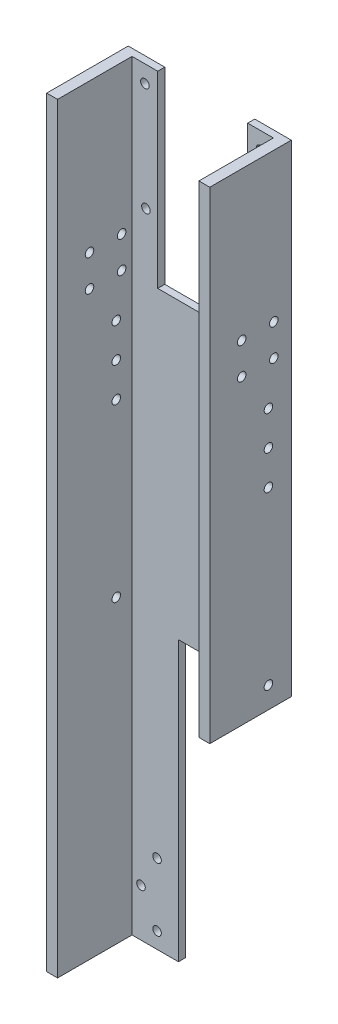
ISO-10303-21;
HEADER;
FILE_DESCRIPTION(('STEP AP214'),'2;1');
FILE_NAME('part.step','',(''),(''),'','','');
FILE_SCHEMA(('AUTOMOTIVE_DESIGN { 1 0 10303 214 1 1 1 1 }'));
ENDSEC;
DATA;
#1=APPLICATION_CONTEXT('core data for automotive mechanical design processes');
#2=APPLICATION_PROTOCOL_DEFINITION('international standard','automotive_design',2000,#1);
#3=PRODUCT_CONTEXT('',#1,'mechanical');
#4=PRODUCT('Part','Part','',(#3));
#5=PRODUCT_RELATED_PRODUCT_CATEGORY('part','',(#4));
#6=PRODUCT_DEFINITION_FORMATION('','',#4);
#7=PRODUCT_DEFINITION_CONTEXT('part definition',#1,'design');
#8=PRODUCT_DEFINITION('design','',#6,#7);
#9=PRODUCT_DEFINITION_SHAPE('','',#8);
#10=(LENGTH_UNIT() NAMED_UNIT(*) SI_UNIT(.MILLI.,.METRE.));
#11=(NAMED_UNIT(*) PLANE_ANGLE_UNIT() SI_UNIT($,.RADIAN.));
#12=(NAMED_UNIT(*) SI_UNIT($,.STERADIAN.) SOLID_ANGLE_UNIT());
#13=UNCERTAINTY_MEASURE_WITH_UNIT(LENGTH_MEASURE(1.E-05),#10,'distance_accuracy_value','');
#14=(GEOMETRIC_REPRESENTATION_CONTEXT(3) GLOBAL_UNCERTAINTY_ASSIGNED_CONTEXT((#13)) GLOBAL_UNIT_ASSIGNED_CONTEXT((#10,
#11,#12)) REPRESENTATION_CONTEXT('',''));
#15=CARTESIAN_POINT('',(0.,0.,0.));
#16=DIRECTION('',(0.,0.,1.));
#17=DIRECTION('',(1.,0.,0.));
#18=AXIS2_PLACEMENT_3D('',#15,#16,#17);
#19=CARTESIAN_POINT('',(38.1,177.8,19.05));
#20=DIRECTION('',(-1.,0.,0.));
#21=DIRECTION('',(0.,0.,1.));
#22=AXIS2_PLACEMENT_3D('',#19,#20,#21);
#23=PLANE('',#22);
#24=CARTESIAN_POINT('',(38.1,58.5851,-8.375));
#25=DIRECTION('',(-1.,0.,0.));
#26=DIRECTION('',(0.,0.,1.));
#27=AXIS2_PLACEMENT_3D('',#24,#25,#26);
#28=CIRCLE('',#27,2.);
#29=CARTESIAN_POINT('',(38.1,58.5851,-6.375));
#30=VERTEX_POINT('',#29);
#31=EDGE_CURVE('E231',#30,#30,#28,.T.);
#32=ORIENTED_EDGE('',*,*,#31,.T.);
#33=EDGE_LOOP('',(#32));
#34=FACE_BOUND('',#33,.T.);
#35=CARTESIAN_POINT('',(38.1,108.363,-10.875));
#36=DIRECTION('',(-1.,0.,0.));
#37=DIRECTION('',(0.,0.,1.));
#38=AXIS2_PLACEMENT_3D('',#35,#36,#37);
#39=CIRCLE('',#38,2.);
#40=CARTESIAN_POINT('',(38.1,108.363,-8.87500000000005));
#41=VERTEX_POINT('',#40);
#42=EDGE_CURVE('E192',#41,#41,#39,.T.);
#43=ORIENTED_EDGE('',*,*,#42,.T.);
#44=EDGE_LOOP('',(#43));
#45=FACE_BOUND('',#44,.T.);
#46=CARTESIAN_POINT('',(38.1,108.363,4.12499999999995));
#47=DIRECTION('',(-1.,0.,0.));
#48=DIRECTION('',(0.,0.,1.));
#49=AXIS2_PLACEMENT_3D('',#46,#47,#48);
#50=CIRCLE('',#49,2.);
#51=CARTESIAN_POINT('',(38.1,108.363,6.12499999999995));
#52=VERTEX_POINT('',#51);
#53=EDGE_CURVE('E184',#52,#52,#50,.T.);
#54=ORIENTED_EDGE('',*,*,#53,.T.);
#55=EDGE_LOOP('',(#54));
#56=FACE_BOUND('',#55,.T.);
#57=CARTESIAN_POINT('',(38.1,93.638,4.125));
#58=DIRECTION('',(-1.,0.,0.));
#59=DIRECTION('',(0.,0.,1.));
#60=AXIS2_PLACEMENT_3D('',#57,#58,#59);
#61=CIRCLE('',#60,2.);
#62=CARTESIAN_POINT('',(38.1,93.638,6.125));
#63=VERTEX_POINT('',#62);
#64=EDGE_CURVE('E175',#63,#63,#61,.T.);
#65=ORIENTED_EDGE('',*,*,#64,.T.);
#66=EDGE_LOOP('',(#65));
#67=FACE_BOUND('',#66,.T.);
#68=CARTESIAN_POINT('',(38.1,74.5851,-8.375));
#69=DIRECTION('',(-1.,0.,0.));
#70=DIRECTION('',(0.,0.,1.));
#71=AXIS2_PLACEMENT_3D('',#68,#69,#70);
#72=CIRCLE('',#71,2.);
#73=CARTESIAN_POINT('',(38.1,74.5851,-6.375));
#74=VERTEX_POINT('',#73);
#75=EDGE_CURVE('E215',#74,#74,#72,.T.);
#76=ORIENTED_EDGE('',*,*,#75,.T.);
#77=EDGE_LOOP('',(#76));
#78=FACE_BOUND('',#77,.T.);
#79=CARTESIAN_POINT('',(38.1,42.5851,-8.37499999999999));
#80=DIRECTION('',(-1.,0.,0.));
#81=DIRECTION('',(0.,0.,1.));
#82=AXIS2_PLACEMENT_3D('',#79,#80,#81);
#83=CIRCLE('',#82,2.);
#84=CARTESIAN_POINT('',(38.1,42.5851,-6.37499999999999));
#85=VERTEX_POINT('',#84);
#86=EDGE_CURVE('E224',#85,#85,#83,.T.);
#87=ORIENTED_EDGE('',*,*,#86,.T.);
#88=EDGE_LOOP('',(#87));
#89=FACE_BOUND('',#88,.T.);
#90=CARTESIAN_POINT('',(38.1,-37.4269,-8.37499999999999));
#91=DIRECTION('',(-1.,0.,0.));
#92=DIRECTION('',(0.,0.,1.));
#93=AXIS2_PLACEMENT_3D('',#90,#91,#92);
#94=CIRCLE('',#93,2.);
#95=CARTESIAN_POINT('',(38.1,-37.4269,-6.37499999999999));
#96=VERTEX_POINT('',#95);
#97=EDGE_CURVE('E199',#96,#96,#94,.T.);
#98=ORIENTED_EDGE('',*,*,#97,.T.);
#99=EDGE_LOOP('',(#98));
#100=FACE_BOUND('',#99,.T.);
#101=CARTESIAN_POINT('',(38.1,93.638,-10.875));
#102=DIRECTION('',(-1.,0.,0.));
#103=DIRECTION('',(0.,0.,1.));
#104=AXIS2_PLACEMENT_3D('',#101,#102,#103);
#105=CIRCLE('',#104,2.);
#106=CARTESIAN_POINT('',(38.1,93.638,-8.875));
#107=VERTEX_POINT('',#106);
#108=EDGE_CURVE('E208',#107,#107,#105,.T.);
#109=ORIENTED_EDGE('',*,*,#108,.T.);
#110=EDGE_LOOP('',(#109));
#111=FACE_BOUND('',#110,.T.);
#112=DIRECTION('',(0.,0.,-1.));
#113=VECTOR('',#112,1.);
#114=CARTESIAN_POINT('',(38.1,-47.4269,519.626216552193));
#115=LINE('',#114,#113);
#116=CARTESIAN_POINT('',(38.1,-47.4269,19.05));
#117=VERTEX_POINT('',#116);
#118=CARTESIAN_POINT('',(38.1,-47.4269,-19.05));
#119=VERTEX_POINT('',#118);
#120=EDGE_CURVE('E155',#117,#119,#115,.T.);
#121=ORIENTED_EDGE('',*,*,#120,.T.);
#122=DIRECTION('',(0.,-1.,0.));
#123=VECTOR('',#122,1.);
#124=CARTESIAN_POINT('',(38.1,177.8,-19.05));
#125=LINE('',#124,#123);
#126=CARTESIAN_POINT('',(38.1,177.8,-19.05));
#127=VERTEX_POINT('',#126);
#128=EDGE_CURVE('E437',#127,#119,#125,.T.);
#129=ORIENTED_EDGE('',*,*,#128,.F.);
#130=DIRECTION('',(0.,0.,-1.));
#131=VECTOR('',#130,1.);
#132=CARTESIAN_POINT('',(38.1,177.8,19.05));
#133=LINE('',#132,#131);
#134=CARTESIAN_POINT('',(38.1,177.8,19.05));
#135=VERTEX_POINT('',#134);
#136=EDGE_CURVE('E369',#135,#127,#133,.T.);
#137=ORIENTED_EDGE('',*,*,#136,.F.);
#138=DIRECTION('',(0.,-1.,0.));
#139=VECTOR('',#138,1.);
#140=CARTESIAN_POINT('',(38.1,177.8,19.05));
#141=LINE('',#140,#139);
#142=EDGE_CURVE('E398',#135,#117,#141,.T.);
#143=ORIENTED_EDGE('',*,*,#142,.T.);
#144=EDGE_LOOP('',(#121,#129,#137,#143));
#145=FACE_BOUND('',#144,.T.);
#146=ADVANCED_FACE('F38',(#34,#45,#56,#67,#78,#89,#100,#111,#145),#23,.F.);
#147=CARTESIAN_POINT('',(-38.1,177.8,-19.05));
#148=DIRECTION('',(0.,0.,1.));
#149=DIRECTION('',(1.,0.,0.));
#150=AXIS2_PLACEMENT_3D('',#147,#148,#149);
#151=PLANE('',#150);
#152=CARTESIAN_POINT('',(-27.0203693429844,169.8,-19.05));
#153=DIRECTION('',(0.,0.,1.));
#154=DIRECTION('',(1.,0.,0.));
#155=AXIS2_PLACEMENT_3D('',#152,#153,#154);
#156=CIRCLE('',#155,2.00000000000001);
#157=CARTESIAN_POINT('',(-25.0203693429844,169.8,-19.05));
#158=VERTEX_POINT('',#157);
#159=EDGE_CURVE('E361',#158,#158,#156,.T.);
#160=ORIENTED_EDGE('',*,*,#159,.T.);
#161=EDGE_LOOP('',(#160));
#162=FACE_BOUND('',#161,.T.);
#163=CARTESIAN_POINT('',(-26.52,119.475689003658,-19.05));
#164=DIRECTION('',(0.,0.,1.));
#165=DIRECTION('',(1.,0.,0.));
#166=AXIS2_PLACEMENT_3D('',#163,#164,#165);
#167=CIRCLE('',#166,2.00000000000001);
#168=CARTESIAN_POINT('',(-24.52,119.475689003658,-19.05));
#169=VERTEX_POINT('',#168);
#170=EDGE_CURVE('E335',#169,#169,#167,.T.);
#171=ORIENTED_EDGE('',*,*,#170,.T.);
#172=EDGE_LOOP('',(#171));
#173=FACE_BOUND('',#172,.T.);
#174=CARTESIAN_POINT('',(27.0203693429844,169.8,-19.05));
#175=DIRECTION('',(0.,0.,-1.));
#176=DIRECTION('',(-1.,0.,0.));
#177=AXIS2_PLACEMENT_3D('',#174,#175,#176);
#178=CIRCLE('',#177,2.00000000000001);
#179=CARTESIAN_POINT('',(25.0203693429844,169.8,-19.05));
#180=VERTEX_POINT('',#179);
#181=EDGE_CURVE('E327',#180,#180,#178,.T.);
#182=ORIENTED_EDGE('',*,*,#181,.F.);
#183=EDGE_LOOP('',(#182));
#184=FACE_BOUND('',#183,.T.);
#185=CARTESIAN_POINT('',(26.52,119.475689003658,-19.05));
#186=DIRECTION('',(0.,0.,-1.));
#187=DIRECTION('',(-1.,0.,0.));
#188=AXIS2_PLACEMENT_3D('',#185,#186,#187);
#189=CIRCLE('',#188,2.00000000000001);
#190=CARTESIAN_POINT('',(24.52,119.475689003658,-19.05));
#191=VERTEX_POINT('',#190);
#192=EDGE_CURVE('E303',#191,#191,#189,.T.);
#193=ORIENTED_EDGE('',*,*,#192,.F.);
#194=EDGE_LOOP('',(#193));
#195=FACE_BOUND('',#194,.T.);
#196=CARTESIAN_POINT('',(-21.335,-140.85,-19.05));
#197=DIRECTION('',(0.,0.,1.));
#198=DIRECTION('',(1.,0.,0.));
#199=AXIS2_PLACEMENT_3D('',#196,#197,#198);
#200=CIRCLE('',#199,2.);
#201=CARTESIAN_POINT('',(-19.335,-140.85,-19.05));
#202=VERTEX_POINT('',#201);
#203=EDGE_CURVE('E296',#202,#202,#200,.T.);
#204=ORIENTED_EDGE('',*,*,#203,.T.);
#205=EDGE_LOOP('',(#204));
#206=FACE_BOUND('',#205,.T.);
#207=CARTESIAN_POINT('',(-28.835,-155.575,-19.05));
#208=DIRECTION('',(0.,0.,1.));
#209=DIRECTION('',(1.,0.,0.));
#210=AXIS2_PLACEMENT_3D('',#207,#208,#209);
#211=CIRCLE('',#210,2.);
#212=CARTESIAN_POINT('',(-26.835,-155.575,-19.05));
#213=VERTEX_POINT('',#212);
#214=EDGE_CURVE('E288',#213,#213,#211,.T.);
#215=ORIENTED_EDGE('',*,*,#214,.T.);
#216=EDGE_LOOP('',(#215));
#217=FACE_BOUND('',#216,.T.);
#218=CARTESIAN_POINT('',(-21.335,-170.3,-19.05));
#219=DIRECTION('',(0.,0.,1.));
#220=DIRECTION('',(1.,0.,0.));
#221=AXIS2_PLACEMENT_3D('',#218,#219,#220);
#222=CIRCLE('',#221,2.);
#223=CARTESIAN_POINT('',(-19.335,-170.3,-19.05));
#224=VERTEX_POINT('',#223);
#225=EDGE_CURVE('E279',#224,#224,#222,.T.);
#226=ORIENTED_EDGE('',*,*,#225,.T.);
#227=EDGE_LOOP('',(#226));
#228=FACE_BOUND('',#227,.T.);
#229=DIRECTION('',(1.,0.,0.));
#230=VECTOR('',#229,1.);
#231=CARTESIAN_POINT('',(-38.1,-47.4269,-19.05));
#232=LINE('',#231,#230);
#233=CARTESIAN_POINT('',(-11.335,-47.4269,-19.05));
#234=VERTEX_POINT('',#233);
#235=EDGE_CURVE('E149',#234,#119,#232,.T.);
#236=ORIENTED_EDGE('',*,*,#235,.F.);
#237=DIRECTION('',(0.,1.,0.));
#238=VECTOR('',#237,1.);
#239=CARTESIAN_POINT('',(-11.335,177.8,-19.05));
#240=LINE('',#239,#238);
#241=CARTESIAN_POINT('',(-11.335,-177.8,-19.05));
#242=VERTEX_POINT('',#241);
#243=EDGE_CURVE('E153',#242,#234,#240,.T.);
#244=ORIENTED_EDGE('',*,*,#243,.F.);
#245=DIRECTION('',(-1.,0.,0.));
#246=VECTOR('',#245,1.);
#247=CARTESIAN_POINT('',(-38.1,-177.8,-19.05));
#248=LINE('',#247,#246);
#249=CARTESIAN_POINT('',(-38.1,-177.8,-19.05));
#250=VERTEX_POINT('',#249);
#251=EDGE_CURVE('E365',#242,#250,#248,.T.);
#252=ORIENTED_EDGE('',*,*,#251,.T.);
#253=DIRECTION('',(0.,-1.,0.));
#254=VECTOR('',#253,1.);
#255=CARTESIAN_POINT('',(-38.1,177.8,-19.05));
#256=LINE('',#255,#254);
#257=CARTESIAN_POINT('',(-38.1,177.8,-19.05));
#258=VERTEX_POINT('',#257);
#259=EDGE_CURVE('E433',#258,#250,#256,.T.);
#260=ORIENTED_EDGE('',*,*,#259,.F.);
#261=DIRECTION('',(-1.,0.,0.));
#262=VECTOR('',#261,1.);
#263=CARTESIAN_POINT('',(-38.1,177.8,-19.05));
#264=LINE('',#263,#262);
#265=CARTESIAN_POINT('',(-21.0207386859688,177.8,-19.05));
#266=VERTEX_POINT('',#265);
#267=EDGE_CURVE('E373',#266,#258,#264,.T.);
#268=ORIENTED_EDGE('',*,*,#267,.F.);
#269=DIRECTION('',(0.,-1.,0.));
#270=VECTOR('',#269,1.);
#271=CARTESIAN_POINT('',(-21.0207386859688,177.8,-19.05));
#272=LINE('',#271,#270);
#273=CARTESIAN_POINT('',(-21.0207386859688,89.8923587544602,-19.05));
#274=VERTEX_POINT('',#273);
#275=EDGE_CURVE('E61',#266,#274,#272,.T.);
#276=ORIENTED_EDGE('',*,*,#275,.T.);
#277=DIRECTION('',(1.,0.,0.));
#278=VECTOR('',#277,1.);
#279=CARTESIAN_POINT('',(-21.0207386859688,89.8923587544602,-19.05));
#280=LINE('',#279,#278);
#281=CARTESIAN_POINT('',(21.0207386859688,89.8923587544602,-19.05));
#282=VERTEX_POINT('',#281);
#283=EDGE_CURVE('E347',#274,#282,#280,.T.);
#284=ORIENTED_EDGE('',*,*,#283,.T.);
#285=DIRECTION('',(0.,-1.,0.));
#286=VECTOR('',#285,1.);
#287=CARTESIAN_POINT('',(21.0207386859688,177.8,-19.05));
#288=LINE('',#287,#286);
#289=CARTESIAN_POINT('',(21.0207386859688,177.8,-19.05));
#290=VERTEX_POINT('',#289);
#291=EDGE_CURVE('E313',#290,#282,#288,.T.);
#292=ORIENTED_EDGE('',*,*,#291,.F.);
#293=EDGE_CURVE('E374',#127,#290,#264,.T.);
#294=ORIENTED_EDGE('',*,*,#293,.F.);
#295=ORIENTED_EDGE('',*,*,#128,.T.);
#296=EDGE_LOOP('',(#236,#244,#252,#260,#268,#276,#284,#292,#294,#295));
#297=FACE_BOUND('',#296,.T.);
#298=ADVANCED_FACE('F471',(#162,#173,#184,#195,#206,#217,#228,#297),#151,.F.);
#299=CARTESIAN_POINT('',(-33.02,177.8,-15.748));
#300=DIRECTION('',(0.,0.,-1.));
#301=DIRECTION('',(-1.,0.,0.));
#302=AXIS2_PLACEMENT_3D('',#299,#300,#301);
#303=PLANE('',#302);
#304=CARTESIAN_POINT('',(-27.0203693429844,169.8,-15.748));
#305=DIRECTION('',(0.,0.,1.));
#306=DIRECTION('',(1.,0.,0.));
#307=AXIS2_PLACEMENT_3D('',#304,#305,#306);
#308=CIRCLE('',#307,2.00000000000001);
#309=CARTESIAN_POINT('',(-25.0203693429844,169.8,-15.748));
#310=VERTEX_POINT('',#309);
#311=EDGE_CURVE('E339',#310,#310,#308,.T.);
#312=ORIENTED_EDGE('',*,*,#311,.F.);
#313=EDGE_LOOP('',(#312));
#314=FACE_BOUND('',#313,.T.);
#315=CARTESIAN_POINT('',(-26.52,119.475689003658,-15.748));
#316=DIRECTION('',(0.,0.,1.));
#317=DIRECTION('',(1.,0.,0.));
#318=AXIS2_PLACEMENT_3D('',#315,#316,#317);
#319=CIRCLE('',#318,2.00000000000001);
#320=CARTESIAN_POINT('',(-24.52,119.475689003658,-15.748));
#321=VERTEX_POINT('',#320);
#322=EDGE_CURVE('E340',#321,#321,#319,.T.);
#323=ORIENTED_EDGE('',*,*,#322,.F.);
#324=EDGE_LOOP('',(#323));
#325=FACE_BOUND('',#324,.T.);
#326=CARTESIAN_POINT('',(27.0203693429844,169.8,-15.748));
#327=DIRECTION('',(0.,0.,-1.));
#328=DIRECTION('',(-1.,0.,0.));
#329=AXIS2_PLACEMENT_3D('',#326,#327,#328);
#330=CIRCLE('',#329,2.00000000000001);
#331=CARTESIAN_POINT('',(25.0203693429844,169.8,-15.748));
#332=VERTEX_POINT('',#331);
#333=EDGE_CURVE('E307',#332,#332,#330,.T.);
#334=ORIENTED_EDGE('',*,*,#333,.T.);
#335=EDGE_LOOP('',(#334));
#336=FACE_BOUND('',#335,.T.);
#337=CARTESIAN_POINT('',(26.52,119.475689003658,-15.748));
#338=DIRECTION('',(0.,0.,-1.));
#339=DIRECTION('',(-1.,0.,0.));
#340=AXIS2_PLACEMENT_3D('',#337,#338,#339);
#341=CIRCLE('',#340,2.00000000000001);
#342=CARTESIAN_POINT('',(24.52,119.475689003658,-15.748));
#343=VERTEX_POINT('',#342);
#344=EDGE_CURVE('E308',#343,#343,#341,.T.);
#345=ORIENTED_EDGE('',*,*,#344,.T.);
#346=EDGE_LOOP('',(#345));
#347=FACE_BOUND('',#346,.T.);
#348=CARTESIAN_POINT('',(-21.335,-140.85,-15.748));
#349=DIRECTION('',(0.,0.,1.));
#350=DIRECTION('',(1.,0.,0.));
#351=AXIS2_PLACEMENT_3D('',#348,#349,#350);
#352=CIRCLE('',#351,2.);
#353=CARTESIAN_POINT('',(-19.335,-140.85,-15.748));
#354=VERTEX_POINT('',#353);
#355=EDGE_CURVE('E278',#354,#354,#352,.T.);
#356=ORIENTED_EDGE('',*,*,#355,.F.);
#357=EDGE_LOOP('',(#356));
#358=FACE_BOUND('',#357,.T.);
#359=CARTESIAN_POINT('',(-28.835,-155.575,-15.748));
#360=DIRECTION('',(0.,0.,1.));
#361=DIRECTION('',(1.,0.,0.));
#362=AXIS2_PLACEMENT_3D('',#359,#360,#361);
#363=CIRCLE('',#362,2.);
#364=CARTESIAN_POINT('',(-26.835,-155.575,-15.748));
#365=VERTEX_POINT('',#364);
#366=EDGE_CURVE('E292',#365,#365,#363,.T.);
#367=ORIENTED_EDGE('',*,*,#366,.F.);
#368=EDGE_LOOP('',(#367));
#369=FACE_BOUND('',#368,.T.);
#370=CARTESIAN_POINT('',(-21.335,-170.3,-15.748));
#371=DIRECTION('',(0.,0.,1.));
#372=DIRECTION('',(1.,0.,0.));
#373=AXIS2_PLACEMENT_3D('',#370,#371,#372);
#374=CIRCLE('',#373,2.);
#375=CARTESIAN_POINT('',(-19.335,-170.3,-15.748));
#376=VERTEX_POINT('',#375);
#377=EDGE_CURVE('E284',#376,#376,#374,.T.);
#378=ORIENTED_EDGE('',*,*,#377,.F.);
#379=EDGE_LOOP('',(#378));
#380=FACE_BOUND('',#379,.T.);
#381=DIRECTION('',(-1.,0.,0.));
#382=VECTOR('',#381,1.);
#383=CARTESIAN_POINT('',(-33.02,-47.4269,-15.748));
#384=LINE('',#383,#382);
#385=CARTESIAN_POINT('',(33.02,-47.4269,-15.748));
#386=VERTEX_POINT('',#385);
#387=CARTESIAN_POINT('',(-11.335,-47.4269,-15.748));
#388=VERTEX_POINT('',#387);
#389=EDGE_CURVE('E139',#386,#388,#384,.T.);
#390=ORIENTED_EDGE('',*,*,#389,.F.);
#391=DIRECTION('',(0.,-1.,0.));
#392=VECTOR('',#391,1.);
#393=CARTESIAN_POINT('',(33.02,177.8,-15.748));
#394=LINE('',#393,#392);
#395=CARTESIAN_POINT('',(33.02,177.8,-15.748));
#396=VERTEX_POINT('',#395);
#397=EDGE_CURVE('E419',#396,#386,#394,.T.);
#398=ORIENTED_EDGE('',*,*,#397,.F.);
#399=DIRECTION('',(1.,0.,0.));
#400=VECTOR('',#399,1.);
#401=CARTESIAN_POINT('',(-33.02,177.8,-15.748));
#402=LINE('',#401,#400);
#403=CARTESIAN_POINT('',(21.0207386859688,177.8,-15.748));
#404=VERTEX_POINT('',#403);
#405=EDGE_CURVE('E387',#404,#396,#402,.T.);
#406=ORIENTED_EDGE('',*,*,#405,.F.);
#407=DIRECTION('',(0.,-1.,0.));
#408=VECTOR('',#407,1.);
#409=CARTESIAN_POINT('',(21.0207386859688,177.8,-15.748));
#410=LINE('',#409,#408);
#411=CARTESIAN_POINT('',(21.0207386859688,89.8923587544602,-15.748));
#412=VERTEX_POINT('',#411);
#413=EDGE_CURVE('E283',#404,#412,#410,.T.);
#414=ORIENTED_EDGE('',*,*,#413,.T.);
#415=DIRECTION('',(1.,0.,0.));
#416=VECTOR('',#415,1.);
#417=CARTESIAN_POINT('',(-21.0207386859688,89.8923587544602,-15.748));
#418=LINE('',#417,#416);
#419=CARTESIAN_POINT('',(-21.0207386859688,89.8923587544602,-15.748));
#420=VERTEX_POINT('',#419);
#421=EDGE_CURVE('E348',#420,#412,#418,.T.);
#422=ORIENTED_EDGE('',*,*,#421,.F.);
#423=DIRECTION('',(0.,-1.,0.));
#424=VECTOR('',#423,1.);
#425=CARTESIAN_POINT('',(-21.0207386859688,177.8,-15.748));
#426=LINE('',#425,#424);
#427=CARTESIAN_POINT('',(-21.0207386859688,177.8,-15.748));
#428=VERTEX_POINT('',#427);
#429=EDGE_CURVE('E331',#428,#420,#426,.T.);
#430=ORIENTED_EDGE('',*,*,#429,.F.);
#431=CARTESIAN_POINT('',(-33.02,177.8,-15.748));
#432=VERTEX_POINT('',#431);
#433=EDGE_CURVE('E388',#432,#428,#402,.T.);
#434=ORIENTED_EDGE('',*,*,#433,.F.);
#435=DIRECTION('',(0.,-1.,0.));
#436=VECTOR('',#435,1.);
#437=CARTESIAN_POINT('',(-33.02,177.8,-15.748));
#438=LINE('',#437,#436);
#439=CARTESIAN_POINT('',(-33.02,-177.8,-15.748));
#440=VERTEX_POINT('',#439);
#441=EDGE_CURVE('E422',#432,#440,#438,.T.);
#442=ORIENTED_EDGE('',*,*,#441,.T.);
#443=DIRECTION('',(1.,0.,0.));
#444=VECTOR('',#443,1.);
#445=CARTESIAN_POINT('',(-33.02,-177.8,-15.748));
#446=LINE('',#445,#444);
#447=CARTESIAN_POINT('',(-11.335,-177.8,-15.748));
#448=VERTEX_POINT('',#447);
#449=EDGE_CURVE('E161',#440,#448,#446,.T.);
#450=ORIENTED_EDGE('',*,*,#449,.T.);
#451=DIRECTION('',(0.,-1.,0.));
#452=VECTOR('',#451,1.);
#453=CARTESIAN_POINT('',(-11.335,177.8,-15.748));
#454=LINE('',#453,#452);
#455=EDGE_CURVE('E53',#388,#448,#454,.T.);
#456=ORIENTED_EDGE('',*,*,#455,.F.);
#457=EDGE_LOOP('',(#390,#398,#406,#414,#422,#430,#434,#442,#450,#456));
#458=FACE_BOUND('',#457,.T.);
#459=ADVANCED_FACE('F158',(#314,#325,#336,#347,#358,#369,#380,#458),#303,.F.);
#460=CARTESIAN_POINT('',(33.02,177.8,-15.748));
#461=DIRECTION('',(1.,0.,0.));
#462=DIRECTION('',(0.,0.,-1.));
#463=AXIS2_PLACEMENT_3D('',#460,#461,#462);
#464=PLANE('',#463);
#465=CARTESIAN_POINT('',(33.02,58.5851,-8.375));
#466=DIRECTION('',(1.,0.,0.));
#467=DIRECTION('',(0.,0.,-1.));
#468=AXIS2_PLACEMENT_3D('',#465,#466,#467);
#469=CIRCLE('',#468,2.);
#470=CARTESIAN_POINT('',(33.02,58.5851,-10.375));
#471=VERTEX_POINT('',#470);
#472=EDGE_CURVE('E235',#471,#471,#469,.T.);
#473=ORIENTED_EDGE('',*,*,#472,.T.);
#474=EDGE_LOOP('',(#473));
#475=FACE_BOUND('',#474,.T.);
#476=CARTESIAN_POINT('',(33.02,108.363,-10.875));
#477=DIRECTION('',(1.,0.,0.));
#478=DIRECTION('',(0.,0.,-1.));
#479=AXIS2_PLACEMENT_3D('',#476,#477,#478);
#480=CIRCLE('',#479,2.);
#481=CARTESIAN_POINT('',(33.02,108.363,-12.875));
#482=VERTEX_POINT('',#481);
#483=EDGE_CURVE('E243',#482,#482,#480,.T.);
#484=ORIENTED_EDGE('',*,*,#483,.T.);
#485=EDGE_LOOP('',(#484));
#486=FACE_BOUND('',#485,.T.);
#487=CARTESIAN_POINT('',(33.02,108.363,4.12499999999995));
#488=DIRECTION('',(1.,0.,0.));
#489=DIRECTION('',(0.,0.,-1.));
#490=AXIS2_PLACEMENT_3D('',#487,#488,#489);
#491=CIRCLE('',#490,2.);
#492=CARTESIAN_POINT('',(33.02,108.363,2.12499999999995));
#493=VERTEX_POINT('',#492);
#494=EDGE_CURVE('E248',#493,#493,#491,.T.);
#495=ORIENTED_EDGE('',*,*,#494,.T.);
#496=EDGE_LOOP('',(#495));
#497=FACE_BOUND('',#496,.T.);
#498=CARTESIAN_POINT('',(33.02,93.638,4.125));
#499=DIRECTION('',(1.,0.,0.));
#500=DIRECTION('',(0.,0.,-1.));
#501=AXIS2_PLACEMENT_3D('',#498,#499,#500);
#502=CIRCLE('',#501,2.);
#503=CARTESIAN_POINT('',(33.02,93.638,2.125));
#504=VERTEX_POINT('',#503);
#505=EDGE_CURVE('E253',#504,#504,#502,.T.);
#506=ORIENTED_EDGE('',*,*,#505,.T.);
#507=EDGE_LOOP('',(#506));
#508=FACE_BOUND('',#507,.T.);
#509=CARTESIAN_POINT('',(33.02,74.5851,-8.375));
#510=DIRECTION('',(1.,0.,0.));
#511=DIRECTION('',(0.,0.,-1.));
#512=AXIS2_PLACEMENT_3D('',#509,#510,#511);
#513=CIRCLE('',#512,2.);
#514=CARTESIAN_POINT('',(33.02,74.5851,-10.375));
#515=VERTEX_POINT('',#514);
#516=EDGE_CURVE('E258',#515,#515,#513,.T.);
#517=ORIENTED_EDGE('',*,*,#516,.T.);
#518=EDGE_LOOP('',(#517));
#519=FACE_BOUND('',#518,.T.);
#520=CARTESIAN_POINT('',(33.02,42.5851,-8.37499999999999));
#521=DIRECTION('',(1.,0.,0.));
#522=DIRECTION('',(0.,0.,-1.));
#523=AXIS2_PLACEMENT_3D('',#520,#521,#522);
#524=CIRCLE('',#523,2.);
#525=CARTESIAN_POINT('',(33.02,42.5851,-10.375));
#526=VERTEX_POINT('',#525);
#527=EDGE_CURVE('E263',#526,#526,#524,.T.);
#528=ORIENTED_EDGE('',*,*,#527,.T.);
#529=EDGE_LOOP('',(#528));
#530=FACE_BOUND('',#529,.T.);
#531=CARTESIAN_POINT('',(33.02,-37.4269,-8.37499999999999));
#532=DIRECTION('',(1.,0.,0.));
#533=DIRECTION('',(0.,0.,-1.));
#534=AXIS2_PLACEMENT_3D('',#531,#532,#533);
#535=CIRCLE('',#534,2.);
#536=CARTESIAN_POINT('',(33.02,-37.4269,-10.375));
#537=VERTEX_POINT('',#536);
#538=EDGE_CURVE('E268',#537,#537,#535,.T.);
#539=ORIENTED_EDGE('',*,*,#538,.T.);
#540=EDGE_LOOP('',(#539));
#541=FACE_BOUND('',#540,.T.);
#542=CARTESIAN_POINT('',(33.02,93.638,-10.875));
#543=DIRECTION('',(1.,0.,0.));
#544=DIRECTION('',(0.,0.,-1.));
#545=AXIS2_PLACEMENT_3D('',#542,#543,#544);
#546=CIRCLE('',#545,2.);
#547=CARTESIAN_POINT('',(33.02,93.638,-12.875));
#548=VERTEX_POINT('',#547);
#549=EDGE_CURVE('E273',#548,#548,#546,.T.);
#550=ORIENTED_EDGE('',*,*,#549,.T.);
#551=EDGE_LOOP('',(#550));
#552=FACE_BOUND('',#551,.T.);
#553=DIRECTION('',(0.,0.,-1.));
#554=VECTOR('',#553,1.);
#555=CARTESIAN_POINT('',(33.02,-47.4269,-15.748));
#556=LINE('',#555,#554);
#557=CARTESIAN_POINT('',(33.02,-47.4269,19.05));
#558=VERTEX_POINT('',#557);
#559=EDGE_CURVE('E144',#558,#386,#556,.T.);
#560=ORIENTED_EDGE('',*,*,#559,.F.);
#561=DIRECTION('',(0.,-1.,0.));
#562=VECTOR('',#561,1.);
#563=CARTESIAN_POINT('',(33.02,177.8,19.05));
#564=LINE('',#563,#562);
#565=CARTESIAN_POINT('',(33.02,177.8,19.05));
#566=VERTEX_POINT('',#565);
#567=EDGE_CURVE('E415',#566,#558,#564,.T.);
#568=ORIENTED_EDGE('',*,*,#567,.F.);
#569=DIRECTION('',(0.,0.,1.));
#570=VECTOR('',#569,1.);
#571=CARTESIAN_POINT('',(33.02,177.8,-15.748));
#572=LINE('',#571,#570);
#573=EDGE_CURVE('E392',#396,#566,#572,.T.);
#574=ORIENTED_EDGE('',*,*,#573,.F.);
#575=ORIENTED_EDGE('',*,*,#397,.T.);
#576=EDGE_LOOP('',(#560,#568,#574,#575));
#577=FACE_BOUND('',#576,.T.);
#578=ADVANCED_FACE('F483',(#475,#486,#497,#508,#519,#530,#541,#552,#577),#464,.F.);
#579=CARTESIAN_POINT('',(33.02,177.8,19.05));
#580=DIRECTION('',(0.,0.,-1.));
#581=DIRECTION('',(-1.,0.,0.));
#582=AXIS2_PLACEMENT_3D('',#579,#580,#581);
#583=PLANE('',#582);
#584=DIRECTION('',(-1.,0.,0.));
#585=VECTOR('',#584,1.);
#586=CARTESIAN_POINT('',(33.02,-47.4269,19.05));
#587=LINE('',#586,#585);
#588=EDGE_CURVE('E11',#117,#558,#587,.T.);
#589=ORIENTED_EDGE('',*,*,#588,.F.);
#590=ORIENTED_EDGE('',*,*,#142,.F.);
#591=DIRECTION('',(1.,0.,0.));
#592=VECTOR('',#591,1.);
#593=CARTESIAN_POINT('',(33.02,177.8,19.05));
#594=LINE('',#593,#592);
#595=EDGE_CURVE('E395',#566,#135,#594,.T.);
#596=ORIENTED_EDGE('',*,*,#595,.F.);
#597=ORIENTED_EDGE('',*,*,#567,.T.);
#598=EDGE_LOOP('',(#589,#590,#596,#597));
#599=FACE_BOUND('',#598,.T.);
#600=ADVANCED_FACE('F480',(#599),#583,.F.);
#601=CARTESIAN_POINT('',(0.,-177.8,0.));
#602=DIRECTION('',(0.,-1.,0.));
#603=DIRECTION('',(0.,0.,-1.));
#604=AXIS2_PLACEMENT_3D('',#601,#602,#603);
#605=PLANE('',#604);
#606=ORIENTED_EDGE('',*,*,#251,.F.);
#607=DIRECTION('',(0.,0.,1.));
#608=VECTOR('',#607,1.);
#609=CARTESIAN_POINT('',(-11.335,-177.8,0.));
#610=LINE('',#609,#608);
#611=EDGE_CURVE('E46',#242,#448,#610,.T.);
#612=ORIENTED_EDGE('',*,*,#611,.T.);
#613=ORIENTED_EDGE('',*,*,#449,.F.);
#614=DIRECTION('',(0.,0.,-1.));
#615=VECTOR('',#614,1.);
#616=CARTESIAN_POINT('',(-33.02,-177.8,19.05));
#617=LINE('',#616,#615);
#618=CARTESIAN_POINT('',(-33.02,-177.8,19.05));
#619=VERTEX_POINT('',#618);
#620=EDGE_CURVE('E407',#619,#440,#617,.T.);
#621=ORIENTED_EDGE('',*,*,#620,.F.);
#622=DIRECTION('',(1.,0.,0.));
#623=VECTOR('',#622,1.);
#624=CARTESIAN_POINT('',(-38.1,-177.8,19.05));
#625=LINE('',#624,#623);
#626=CARTESIAN_POINT('',(-38.1,-177.8,19.05));
#627=VERTEX_POINT('',#626);
#628=EDGE_CURVE('E404',#627,#619,#625,.T.);
#629=ORIENTED_EDGE('',*,*,#628,.F.);
#630=DIRECTION('',(0.,0.,1.));
#631=VECTOR('',#630,1.);
#632=CARTESIAN_POINT('',(-38.1,-177.8,19.05));
#633=LINE('',#632,#631);
#634=EDGE_CURVE('E401',#250,#627,#633,.T.);
#635=ORIENTED_EDGE('',*,*,#634,.F.);
#636=EDGE_LOOP('',(#606,#612,#613,#621,#629,#635));
#637=FACE_BOUND('',#636,.T.);
#638=ADVANCED_FACE('F467',(#637),#605,.T.);
#639=CARTESIAN_POINT('',(0.,177.8,0.));
#640=DIRECTION('',(0.,-1.,0.));
#641=DIRECTION('',(0.,0.,-1.));
#642=AXIS2_PLACEMENT_3D('',#639,#640,#641);
#643=PLANE('',#642);
#644=DIRECTION('',(0.,0.,1.));
#645=VECTOR('',#644,1.);
#646=CARTESIAN_POINT('',(21.0207386859688,177.8,-19.05));
#647=LINE('',#646,#645);
#648=EDGE_CURVE('E312',#290,#404,#647,.T.);
#649=ORIENTED_EDGE('',*,*,#648,.T.);
#650=ORIENTED_EDGE('',*,*,#405,.T.);
#651=ORIENTED_EDGE('',*,*,#573,.T.);
#652=ORIENTED_EDGE('',*,*,#595,.T.);
#653=ORIENTED_EDGE('',*,*,#136,.T.);
#654=ORIENTED_EDGE('',*,*,#293,.T.);
#655=EDGE_LOOP('',(#649,#650,#651,#652,#653,#654));
#656=FACE_BOUND('',#655,.T.);
#657=ADVANCED_FACE('F516',(#656),#643,.F.);
#658=CARTESIAN_POINT('',(-38.1,177.8,19.05));
#659=DIRECTION('',(1.,0.,0.));
#660=DIRECTION('',(0.,0.,-1.));
#661=AXIS2_PLACEMENT_3D('',#658,#659,#660);
#662=PLANE('',#661);
#663=CARTESIAN_POINT('',(-38.1,93.638,-10.875));
#664=DIRECTION('',(-1.,0.,0.));
#665=DIRECTION('',(0.,0.,1.));
#666=AXIS2_PLACEMENT_3D('',#663,#664,#665);
#667=CIRCLE('',#666,2.);
#668=CARTESIAN_POINT('',(-38.1,93.638,-8.875));
#669=VERTEX_POINT('',#668);
#670=EDGE_CURVE('E179',#669,#669,#667,.T.);
#671=ORIENTED_EDGE('',*,*,#670,.F.);
#672=EDGE_LOOP('',(#671));
#673=FACE_BOUND('',#672,.T.);
#674=CARTESIAN_POINT('',(-38.1,-37.4269,-8.37499999999999));
#675=DIRECTION('',(-1.,0.,0.));
#676=DIRECTION('',(0.,0.,1.));
#677=AXIS2_PLACEMENT_3D('',#674,#675,#676);
#678=CIRCLE('',#677,2.);
#679=CARTESIAN_POINT('',(-38.1,-37.4269,-6.37499999999999));
#680=VERTEX_POINT('',#679);
#681=EDGE_CURVE('E204',#680,#680,#678,.T.);
#682=ORIENTED_EDGE('',*,*,#681,.F.);
#683=EDGE_LOOP('',(#682));
#684=FACE_BOUND('',#683,.T.);
#685=CARTESIAN_POINT('',(-38.1,42.5851,-8.37499999999999));
#686=DIRECTION('',(-1.,0.,0.));
#687=DIRECTION('',(0.,0.,1.));
#688=AXIS2_PLACEMENT_3D('',#685,#686,#687);
#689=CIRCLE('',#688,2.);
#690=CARTESIAN_POINT('',(-38.1,42.5851,-6.37499999999999));
#691=VERTEX_POINT('',#690);
#692=EDGE_CURVE('E203',#691,#691,#689,.T.);
#693=ORIENTED_EDGE('',*,*,#692,.F.);
#694=EDGE_LOOP('',(#693));
#695=FACE_BOUND('',#694,.T.);
#696=CARTESIAN_POINT('',(-38.1,74.5851,-8.375));
#697=DIRECTION('',(-1.,0.,0.));
#698=DIRECTION('',(0.,0.,1.));
#699=AXIS2_PLACEMENT_3D('',#696,#697,#698);
#700=CIRCLE('',#699,2.);
#701=CARTESIAN_POINT('',(-38.1,74.5851,-6.375));
#702=VERTEX_POINT('',#701);
#703=EDGE_CURVE('E220',#702,#702,#700,.T.);
#704=ORIENTED_EDGE('',*,*,#703,.F.);
#705=EDGE_LOOP('',(#704));
#706=FACE_BOUND('',#705,.T.);
#707=CARTESIAN_POINT('',(-38.1,93.638,4.125));
#708=DIRECTION('',(-1.,0.,0.));
#709=DIRECTION('',(0.,0.,1.));
#710=AXIS2_PLACEMENT_3D('',#707,#708,#709);
#711=CIRCLE('',#710,2.);
#712=CARTESIAN_POINT('',(-38.1,93.638,6.125));
#713=VERTEX_POINT('',#712);
#714=EDGE_CURVE('E180',#713,#713,#711,.T.);
#715=ORIENTED_EDGE('',*,*,#714,.F.);
#716=EDGE_LOOP('',(#715));
#717=FACE_BOUND('',#716,.T.);
#718=CARTESIAN_POINT('',(-38.1,108.363,4.12499999999995));
#719=DIRECTION('',(-1.,0.,0.));
#720=DIRECTION('',(0.,0.,1.));
#721=AXIS2_PLACEMENT_3D('',#718,#719,#720);
#722=CIRCLE('',#721,2.);
#723=CARTESIAN_POINT('',(-38.1,108.363,6.12499999999995));
#724=VERTEX_POINT('',#723);
#725=EDGE_CURVE('E188',#724,#724,#722,.T.);
#726=ORIENTED_EDGE('',*,*,#725,.F.);
#727=EDGE_LOOP('',(#726));
#728=FACE_BOUND('',#727,.T.);
#729=CARTESIAN_POINT('',(-38.1,108.363,-10.875));
#730=DIRECTION('',(-1.,0.,0.));
#731=DIRECTION('',(0.,0.,1.));
#732=AXIS2_PLACEMENT_3D('',#729,#730,#731);
#733=CIRCLE('',#732,2.);
#734=CARTESIAN_POINT('',(-38.1,108.363,-8.87500000000005));
#735=VERTEX_POINT('',#734);
#736=EDGE_CURVE('E174',#735,#735,#733,.T.);
#737=ORIENTED_EDGE('',*,*,#736,.F.);
#738=EDGE_LOOP('',(#737));
#739=FACE_BOUND('',#738,.T.);
#740=CARTESIAN_POINT('',(-38.1,58.5851,-8.375));
#741=DIRECTION('',(-1.,0.,0.));
#742=DIRECTION('',(0.,0.,1.));
#743=AXIS2_PLACEMENT_3D('',#740,#741,#742);
#744=CIRCLE('',#743,2.);
#745=CARTESIAN_POINT('',(-38.1,58.5851,-6.375));
#746=VERTEX_POINT('',#745);
#747=EDGE_CURVE('E219',#746,#746,#744,.T.);
#748=ORIENTED_EDGE('',*,*,#747,.F.);
#749=EDGE_LOOP('',(#748));
#750=FACE_BOUND('',#749,.T.);
#751=ORIENTED_EDGE('',*,*,#634,.T.);
#752=DIRECTION('',(0.,-1.,0.));
#753=VECTOR('',#752,1.);
#754=CARTESIAN_POINT('',(-38.1,177.8,19.05));
#755=LINE('',#754,#753);
#756=CARTESIAN_POINT('',(-38.1,177.8,19.05));
#757=VERTEX_POINT('',#756);
#758=EDGE_CURVE('E429',#757,#627,#755,.T.);
#759=ORIENTED_EDGE('',*,*,#758,.F.);
#760=DIRECTION('',(0.,0.,1.));
#761=VECTOR('',#760,1.);
#762=CARTESIAN_POINT('',(-38.1,177.8,19.05));
#763=LINE('',#762,#761);
#764=EDGE_CURVE('E378',#258,#757,#763,.T.);
#765=ORIENTED_EDGE('',*,*,#764,.F.);
#766=ORIENTED_EDGE('',*,*,#259,.T.);
#767=EDGE_LOOP('',(#751,#759,#765,#766));
#768=FACE_BOUND('',#767,.T.);
#769=ADVANCED_FACE('F496',(#673,#684,#695,#706,#717,#728,#739,#750,#768),#662,.F.);
#770=CARTESIAN_POINT('',(-38.1,177.8,19.05));
#771=DIRECTION('',(0.,0.,-1.));
#772=DIRECTION('',(-1.,0.,0.));
#773=AXIS2_PLACEMENT_3D('',#770,#771,#772);
#774=PLANE('',#773);
#775=ORIENTED_EDGE('',*,*,#628,.T.);
#776=DIRECTION('',(0.,-1.,0.));
#777=VECTOR('',#776,1.);
#778=CARTESIAN_POINT('',(-33.02,177.8,19.05));
#779=LINE('',#778,#777);
#780=CARTESIAN_POINT('',(-33.02,177.8,19.05));
#781=VERTEX_POINT('',#780);
#782=EDGE_CURVE('E425',#781,#619,#779,.T.);
#783=ORIENTED_EDGE('',*,*,#782,.F.);
#784=DIRECTION('',(1.,0.,0.));
#785=VECTOR('',#784,1.);
#786=CARTESIAN_POINT('',(-38.1,177.8,19.05));
#787=LINE('',#786,#785);
#788=EDGE_CURVE('E381',#757,#781,#787,.T.);
#789=ORIENTED_EDGE('',*,*,#788,.F.);
#790=ORIENTED_EDGE('',*,*,#758,.T.);
#791=EDGE_LOOP('',(#775,#783,#789,#790));
#792=FACE_BOUND('',#791,.T.);
#793=ADVANCED_FACE('F501',(#792),#774,.F.);
#794=CARTESIAN_POINT('',(-33.02,177.8,19.05));
#795=DIRECTION('',(-1.,0.,0.));
#796=DIRECTION('',(0.,0.,1.));
#797=AXIS2_PLACEMENT_3D('',#794,#795,#796);
#798=PLANE('',#797);
#799=CARTESIAN_POINT('',(-33.02,93.638,-10.875));
#800=DIRECTION('',(-1.,0.,0.));
#801=DIRECTION('',(0.,0.,1.));
#802=AXIS2_PLACEMENT_3D('',#799,#800,#801);
#803=CIRCLE('',#802,2.);
#804=CARTESIAN_POINT('',(-33.02,93.638,-8.875));
#805=VERTEX_POINT('',#804);
#806=EDGE_CURVE('E274',#805,#805,#803,.T.);
#807=ORIENTED_EDGE('',*,*,#806,.T.);
#808=EDGE_LOOP('',(#807));
#809=FACE_BOUND('',#808,.T.);
#810=CARTESIAN_POINT('',(-33.02,-37.4269,-8.37499999999999));
#811=DIRECTION('',(-1.,0.,0.));
#812=DIRECTION('',(0.,0.,1.));
#813=AXIS2_PLACEMENT_3D('',#810,#811,#812);
#814=CIRCLE('',#813,2.);
#815=CARTESIAN_POINT('',(-33.02,-37.4269,-6.37499999999999));
#816=VERTEX_POINT('',#815);
#817=EDGE_CURVE('E269',#816,#816,#814,.T.);
#818=ORIENTED_EDGE('',*,*,#817,.T.);
#819=EDGE_LOOP('',(#818));
#820=FACE_BOUND('',#819,.T.);
#821=CARTESIAN_POINT('',(-33.02,42.5851,-8.37499999999999));
#822=DIRECTION('',(-1.,0.,0.));
#823=DIRECTION('',(0.,0.,1.));
#824=AXIS2_PLACEMENT_3D('',#821,#822,#823);
#825=CIRCLE('',#824,2.);
#826=CARTESIAN_POINT('',(-33.02,42.5851,-6.37499999999999));
#827=VERTEX_POINT('',#826);
#828=EDGE_CURVE('E264',#827,#827,#825,.T.);
#829=ORIENTED_EDGE('',*,*,#828,.T.);
#830=EDGE_LOOP('',(#829));
#831=FACE_BOUND('',#830,.T.);
#832=CARTESIAN_POINT('',(-33.02,74.5851,-8.375));
#833=DIRECTION('',(-1.,0.,0.));
#834=DIRECTION('',(0.,0.,1.));
#835=AXIS2_PLACEMENT_3D('',#832,#833,#834);
#836=CIRCLE('',#835,2.);
#837=CARTESIAN_POINT('',(-33.02,74.5851,-6.375));
#838=VERTEX_POINT('',#837);
#839=EDGE_CURVE('E259',#838,#838,#836,.T.);
#840=ORIENTED_EDGE('',*,*,#839,.T.);
#841=EDGE_LOOP('',(#840));
#842=FACE_BOUND('',#841,.T.);
#843=CARTESIAN_POINT('',(-33.02,93.638,4.125));
#844=DIRECTION('',(-1.,0.,0.));
#845=DIRECTION('',(0.,0.,1.));
#846=AXIS2_PLACEMENT_3D('',#843,#844,#845);
#847=CIRCLE('',#846,2.);
#848=CARTESIAN_POINT('',(-33.02,93.638,6.125));
#849=VERTEX_POINT('',#848);
#850=EDGE_CURVE('E254',#849,#849,#847,.T.);
#851=ORIENTED_EDGE('',*,*,#850,.T.);
#852=EDGE_LOOP('',(#851));
#853=FACE_BOUND('',#852,.T.);
#854=CARTESIAN_POINT('',(-33.02,108.363,4.12499999999995));
#855=DIRECTION('',(-1.,0.,0.));
#856=DIRECTION('',(0.,0.,1.));
#857=AXIS2_PLACEMENT_3D('',#854,#855,#856);
#858=CIRCLE('',#857,2.);
#859=CARTESIAN_POINT('',(-33.02,108.363,6.12499999999995));
#860=VERTEX_POINT('',#859);
#861=EDGE_CURVE('E249',#860,#860,#858,.T.);
#862=ORIENTED_EDGE('',*,*,#861,.T.);
#863=EDGE_LOOP('',(#862));
#864=FACE_BOUND('',#863,.T.);
#865=CARTESIAN_POINT('',(-33.02,108.363,-10.875));
#866=DIRECTION('',(-1.,0.,0.));
#867=DIRECTION('',(0.,0.,1.));
#868=AXIS2_PLACEMENT_3D('',#865,#866,#867);
#869=CIRCLE('',#868,2.);
#870=CARTESIAN_POINT('',(-33.02,108.363,-8.87500000000005));
#871=VERTEX_POINT('',#870);
#872=EDGE_CURVE('E244',#871,#871,#869,.T.);
#873=ORIENTED_EDGE('',*,*,#872,.T.);
#874=EDGE_LOOP('',(#873));
#875=FACE_BOUND('',#874,.T.);
#876=CARTESIAN_POINT('',(-33.02,58.5851,-8.375));
#877=DIRECTION('',(-1.,0.,0.));
#878=DIRECTION('',(0.,0.,1.));
#879=AXIS2_PLACEMENT_3D('',#876,#877,#878);
#880=CIRCLE('',#879,2.);
#881=CARTESIAN_POINT('',(-33.02,58.5851,-6.375));
#882=VERTEX_POINT('',#881);
#883=EDGE_CURVE('E239',#882,#882,#880,.T.);
#884=ORIENTED_EDGE('',*,*,#883,.T.);
#885=EDGE_LOOP('',(#884));
#886=FACE_BOUND('',#885,.T.);
#887=ORIENTED_EDGE('',*,*,#620,.T.);
#888=ORIENTED_EDGE('',*,*,#441,.F.);
#889=DIRECTION('',(0.,0.,-1.));
#890=VECTOR('',#889,1.);
#891=CARTESIAN_POINT('',(-33.02,177.8,19.05));
#892=LINE('',#891,#890);
#893=EDGE_CURVE('E384',#781,#432,#892,.T.);
#894=ORIENTED_EDGE('',*,*,#893,.F.);
#895=ORIENTED_EDGE('',*,*,#782,.T.);
#896=EDGE_LOOP('',(#887,#888,#894,#895));
#897=FACE_BOUND('',#896,.T.);
#898=ADVANCED_FACE('F506',(#809,#820,#831,#842,#853,#864,#875,#886,#897),#798,.F.);
#899=ORIENTED_EDGE('',*,*,#433,.T.);
#900=DIRECTION('',(0.,0.,1.));
#901=VECTOR('',#900,1.);
#902=CARTESIAN_POINT('',(-21.0207386859688,177.8,-19.05));
#903=LINE('',#902,#901);
#904=EDGE_CURVE('E351',#266,#428,#903,.T.);
#905=ORIENTED_EDGE('',*,*,#904,.F.);
#906=ORIENTED_EDGE('',*,*,#267,.T.);
#907=ORIENTED_EDGE('',*,*,#764,.T.);
#908=ORIENTED_EDGE('',*,*,#788,.T.);
#909=ORIENTED_EDGE('',*,*,#893,.T.);
#910=EDGE_LOOP('',(#899,#905,#906,#907,#908,#909));
#911=FACE_BOUND('',#910,.T.);
#912=ADVANCED_FACE('F492',(#911),#643,.F.);
#913=CARTESIAN_POINT('',(-21.0207386859688,89.8923587544602,-19.05));
#914=DIRECTION('',(0.,-1.,0.));
#915=DIRECTION('',(0.,0.,-1.));
#916=AXIS2_PLACEMENT_3D('',#913,#914,#915);
#917=PLANE('',#916);
#918=ORIENTED_EDGE('',*,*,#421,.T.);
#919=DIRECTION('',(0.,0.,1.));
#920=VECTOR('',#919,1.);
#921=CARTESIAN_POINT('',(21.0207386859688,89.8923587544602,-19.05));
#922=LINE('',#921,#920);
#923=EDGE_CURVE('E317',#282,#412,#922,.T.);
#924=ORIENTED_EDGE('',*,*,#923,.F.);
#925=ORIENTED_EDGE('',*,*,#283,.F.);
#926=DIRECTION('',(0.,0.,1.));
#927=VECTOR('',#926,1.);
#928=CARTESIAN_POINT('',(-21.0207386859688,89.8923587544602,-19.05));
#929=LINE('',#928,#927);
#930=EDGE_CURVE('E344',#274,#420,#929,.T.);
#931=ORIENTED_EDGE('',*,*,#930,.T.);
#932=EDGE_LOOP('',(#918,#924,#925,#931));
#933=FACE_BOUND('',#932,.T.);
#934=ADVANCED_FACE('F512',(#933),#917,.F.);
#935=CARTESIAN_POINT('',(-21.0207386859688,177.8,-19.05));
#936=DIRECTION('',(-1.,0.,0.));
#937=DIRECTION('',(0.,-1.,0.));
#938=AXIS2_PLACEMENT_3D('',#935,#936,#937);
#939=PLANE('',#938);
#940=ORIENTED_EDGE('',*,*,#429,.T.);
#941=ORIENTED_EDGE('',*,*,#930,.F.);
#942=ORIENTED_EDGE('',*,*,#275,.F.);
#943=ORIENTED_EDGE('',*,*,#904,.T.);
#944=EDGE_LOOP('',(#940,#941,#942,#943));
#945=FACE_BOUND('',#944,.T.);
#946=ADVANCED_FACE('F508',(#945),#939,.F.);
#947=CARTESIAN_POINT('',(-27.0203693429844,169.8,-19.05));
#948=DIRECTION('',(0.,0.,1.));
#949=DIRECTION('',(1.,0.,0.));
#950=AXIS2_PLACEMENT_3D('',#947,#948,#949);
#951=CYLINDRICAL_SURFACE('',#950,2.00000000000001);
#952=ORIENTED_EDGE('',*,*,#159,.F.);
#953=EDGE_LOOP('',(#952));
#954=FACE_BOUND('',#953,.T.);
#955=ORIENTED_EDGE('',*,*,#311,.T.);
#956=EDGE_LOOP('',(#955));
#957=FACE_BOUND('',#956,.T.);
#958=ADVANCED_FACE('F601',(#954,#957),#951,.F.);
#959=CARTESIAN_POINT('',(-26.52,119.475689003658,-19.05));
#960=DIRECTION('',(0.,0.,1.));
#961=DIRECTION('',(1.,0.,0.));
#962=AXIS2_PLACEMENT_3D('',#959,#960,#961);
#963=CYLINDRICAL_SURFACE('',#962,2.00000000000001);
#964=ORIENTED_EDGE('',*,*,#170,.F.);
#965=EDGE_LOOP('',(#964));
#966=FACE_BOUND('',#965,.T.);
#967=ORIENTED_EDGE('',*,*,#322,.T.);
#968=EDGE_LOOP('',(#967));
#969=FACE_BOUND('',#968,.T.);
#970=ADVANCED_FACE('F608',(#966,#969),#963,.F.);
#971=CARTESIAN_POINT('',(21.0207386859688,177.8,-19.05));
#972=DIRECTION('',(-1.,0.,0.));
#973=DIRECTION('',(0.,-1.,0.));
#974=AXIS2_PLACEMENT_3D('',#971,#972,#973);
#975=PLANE('',#974);
#976=ORIENTED_EDGE('',*,*,#413,.F.);
#977=ORIENTED_EDGE('',*,*,#648,.F.);
#978=ORIENTED_EDGE('',*,*,#291,.T.);
#979=ORIENTED_EDGE('',*,*,#923,.T.);
#980=EDGE_LOOP('',(#976,#977,#978,#979));
#981=FACE_BOUND('',#980,.T.);
#982=ADVANCED_FACE('F515',(#981),#975,.T.);
#983=CARTESIAN_POINT('',(27.0203693429844,169.8,-19.05));
#984=DIRECTION('',(0.,0.,1.));
#985=DIRECTION('',(1.,0.,0.));
#986=AXIS2_PLACEMENT_3D('',#983,#984,#985);
#987=CYLINDRICAL_SURFACE('',#986,2.00000000000001);
#988=ORIENTED_EDGE('',*,*,#181,.T.);
#989=EDGE_LOOP('',(#988));
#990=FACE_BOUND('',#989,.T.);
#991=ORIENTED_EDGE('',*,*,#333,.F.);
#992=EDGE_LOOP('',(#991));
#993=FACE_BOUND('',#992,.T.);
#994=ADVANCED_FACE('F621',(#990,#993),#987,.F.);
#995=CARTESIAN_POINT('',(26.52,119.475689003658,-19.05));
#996=DIRECTION('',(0.,0.,1.));
#997=DIRECTION('',(1.,0.,0.));
#998=AXIS2_PLACEMENT_3D('',#995,#996,#997);
#999=CYLINDRICAL_SURFACE('',#998,2.00000000000001);
#1000=ORIENTED_EDGE('',*,*,#192,.T.);
#1001=EDGE_LOOP('',(#1000));
#1002=FACE_BOUND('',#1001,.T.);
#1003=ORIENTED_EDGE('',*,*,#344,.F.);
#1004=EDGE_LOOP('',(#1003));
#1005=FACE_BOUND('',#1004,.T.);
#1006=ADVANCED_FACE('F628',(#1002,#1005),#999,.F.);
#1007=CARTESIAN_POINT('',(-21.335,-140.85,-19.05));
#1008=DIRECTION('',(0.,0.,1.));
#1009=DIRECTION('',(1.,0.,0.));
#1010=AXIS2_PLACEMENT_3D('',#1007,#1008,#1009);
#1011=CYLINDRICAL_SURFACE('',#1010,2.);
#1012=ORIENTED_EDGE('',*,*,#203,.F.);
#1013=EDGE_LOOP('',(#1012));
#1014=FACE_BOUND('',#1013,.T.);
#1015=ORIENTED_EDGE('',*,*,#355,.T.);
#1016=EDGE_LOOP('',(#1015));
#1017=FACE_BOUND('',#1016,.T.);
#1018=ADVANCED_FACE('F636',(#1014,#1017),#1011,.F.);
#1019=CARTESIAN_POINT('',(-28.835,-155.575,-19.05));
#1020=DIRECTION('',(0.,0.,1.));
#1021=DIRECTION('',(1.,0.,0.));
#1022=AXIS2_PLACEMENT_3D('',#1019,#1020,#1021);
#1023=CYLINDRICAL_SURFACE('',#1022,2.);
#1024=ORIENTED_EDGE('',*,*,#214,.F.);
#1025=EDGE_LOOP('',(#1024));
#1026=FACE_BOUND('',#1025,.T.);
#1027=ORIENTED_EDGE('',*,*,#366,.T.);
#1028=EDGE_LOOP('',(#1027));
#1029=FACE_BOUND('',#1028,.T.);
#1030=ADVANCED_FACE('F644',(#1026,#1029),#1023,.F.);
#1031=CARTESIAN_POINT('',(-21.335,-170.3,-19.05));
#1032=DIRECTION('',(0.,0.,1.));
#1033=DIRECTION('',(1.,0.,0.));
#1034=AXIS2_PLACEMENT_3D('',#1031,#1032,#1033);
#1035=CYLINDRICAL_SURFACE('',#1034,2.);
#1036=ORIENTED_EDGE('',*,*,#225,.F.);
#1037=EDGE_LOOP('',(#1036));
#1038=FACE_BOUND('',#1037,.T.);
#1039=ORIENTED_EDGE('',*,*,#377,.T.);
#1040=EDGE_LOOP('',(#1039));
#1041=FACE_BOUND('',#1040,.T.);
#1042=ADVANCED_FACE('F652',(#1038,#1041),#1035,.F.);
#1043=CARTESIAN_POINT('',(38.1,58.5851,-8.375));
#1044=DIRECTION('',(-1.,0.,0.));
#1045=DIRECTION('',(0.,0.,1.));
#1046=AXIS2_PLACEMENT_3D('',#1043,#1044,#1045);
#1047=CYLINDRICAL_SURFACE('',#1046,2.);
#1048=ORIENTED_EDGE('',*,*,#31,.F.);
#1049=EDGE_LOOP('',(#1048));
#1050=FACE_BOUND('',#1049,.T.);
#1051=ORIENTED_EDGE('',*,*,#472,.F.);
#1052=EDGE_LOOP('',(#1051));
#1053=FACE_BOUND('',#1052,.T.);
#1054=ADVANCED_FACE('F660',(#1050,#1053),#1047,.F.);
#1055=CARTESIAN_POINT('',(38.1,108.363,-10.875));
#1056=DIRECTION('',(-1.,0.,0.));
#1057=DIRECTION('',(0.,0.,1.));
#1058=AXIS2_PLACEMENT_3D('',#1055,#1056,#1057);
#1059=CYLINDRICAL_SURFACE('',#1058,2.);
#1060=ORIENTED_EDGE('',*,*,#42,.F.);
#1061=EDGE_LOOP('',(#1060));
#1062=FACE_BOUND('',#1061,.T.);
#1063=ORIENTED_EDGE('',*,*,#483,.F.);
#1064=EDGE_LOOP('',(#1063));
#1065=FACE_BOUND('',#1064,.T.);
#1066=ADVANCED_FACE('F667',(#1062,#1065),#1059,.F.);
#1067=CARTESIAN_POINT('',(38.1,108.363,4.12499999999995));
#1068=DIRECTION('',(-1.,0.,0.));
#1069=DIRECTION('',(0.,0.,1.));
#1070=AXIS2_PLACEMENT_3D('',#1067,#1068,#1069);
#1071=CYLINDRICAL_SURFACE('',#1070,2.);
#1072=ORIENTED_EDGE('',*,*,#53,.F.);
#1073=EDGE_LOOP('',(#1072));
#1074=FACE_BOUND('',#1073,.T.);
#1075=ORIENTED_EDGE('',*,*,#494,.F.);
#1076=EDGE_LOOP('',(#1075));
#1077=FACE_BOUND('',#1076,.T.);
#1078=ADVANCED_FACE('F675',(#1074,#1077),#1071,.F.);
#1079=CARTESIAN_POINT('',(38.1,93.638,4.125));
#1080=DIRECTION('',(-1.,0.,0.));
#1081=DIRECTION('',(0.,0.,1.));
#1082=AXIS2_PLACEMENT_3D('',#1079,#1080,#1081);
#1083=CYLINDRICAL_SURFACE('',#1082,2.);
#1084=ORIENTED_EDGE('',*,*,#64,.F.);
#1085=EDGE_LOOP('',(#1084));
#1086=FACE_BOUND('',#1085,.T.);
#1087=ORIENTED_EDGE('',*,*,#505,.F.);
#1088=EDGE_LOOP('',(#1087));
#1089=FACE_BOUND('',#1088,.T.);
#1090=ADVANCED_FACE('F684',(#1086,#1089),#1083,.F.);
#1091=CARTESIAN_POINT('',(38.1,74.5851,-8.375));
#1092=DIRECTION('',(-1.,0.,0.));
#1093=DIRECTION('',(0.,0.,1.));
#1094=AXIS2_PLACEMENT_3D('',#1091,#1092,#1093);
#1095=CYLINDRICAL_SURFACE('',#1094,2.);
#1096=ORIENTED_EDGE('',*,*,#75,.F.);
#1097=EDGE_LOOP('',(#1096));
#1098=FACE_BOUND('',#1097,.T.);
#1099=ORIENTED_EDGE('',*,*,#516,.F.);
#1100=EDGE_LOOP('',(#1099));
#1101=FACE_BOUND('',#1100,.T.);
#1102=ADVANCED_FACE('F693',(#1098,#1101),#1095,.F.);
#1103=CARTESIAN_POINT('',(38.1,42.5851,-8.37499999999999));
#1104=DIRECTION('',(-1.,0.,0.));
#1105=DIRECTION('',(0.,0.,1.));
#1106=AXIS2_PLACEMENT_3D('',#1103,#1104,#1105);
#1107=CYLINDRICAL_SURFACE('',#1106,2.);
#1108=ORIENTED_EDGE('',*,*,#86,.F.);
#1109=EDGE_LOOP('',(#1108));
#1110=FACE_BOUND('',#1109,.T.);
#1111=ORIENTED_EDGE('',*,*,#527,.F.);
#1112=EDGE_LOOP('',(#1111));
#1113=FACE_BOUND('',#1112,.T.);
#1114=ADVANCED_FACE('F702',(#1110,#1113),#1107,.F.);
#1115=CARTESIAN_POINT('',(38.1,-37.4269,-8.37499999999999));
#1116=DIRECTION('',(-1.,0.,0.));
#1117=DIRECTION('',(0.,0.,1.));
#1118=AXIS2_PLACEMENT_3D('',#1115,#1116,#1117);
#1119=CYLINDRICAL_SURFACE('',#1118,2.);
#1120=ORIENTED_EDGE('',*,*,#97,.F.);
#1121=EDGE_LOOP('',(#1120));
#1122=FACE_BOUND('',#1121,.T.);
#1123=ORIENTED_EDGE('',*,*,#538,.F.);
#1124=EDGE_LOOP('',(#1123));
#1125=FACE_BOUND('',#1124,.T.);
#1126=ADVANCED_FACE('F554',(#1122,#1125),#1119,.F.);
#1127=CARTESIAN_POINT('',(38.1,93.638,-10.875));
#1128=DIRECTION('',(-1.,0.,0.));
#1129=DIRECTION('',(0.,0.,1.));
#1130=AXIS2_PLACEMENT_3D('',#1127,#1128,#1129);
#1131=CYLINDRICAL_SURFACE('',#1130,2.);
#1132=ORIENTED_EDGE('',*,*,#108,.F.);
#1133=EDGE_LOOP('',(#1132));
#1134=FACE_BOUND('',#1133,.T.);
#1135=ORIENTED_EDGE('',*,*,#549,.F.);
#1136=EDGE_LOOP('',(#1135));
#1137=FACE_BOUND('',#1136,.T.);
#1138=ADVANCED_FACE('F550',(#1134,#1137),#1131,.F.);
#1139=ORIENTED_EDGE('',*,*,#747,.T.);
#1140=EDGE_LOOP('',(#1139));
#1141=FACE_BOUND('',#1140,.T.);
#1142=ORIENTED_EDGE('',*,*,#883,.F.);
#1143=EDGE_LOOP('',(#1142));
#1144=FACE_BOUND('',#1143,.T.);
#1145=ADVANCED_FACE('F553',(#1141,#1144),#1047,.F.);
#1146=ORIENTED_EDGE('',*,*,#736,.T.);
#1147=EDGE_LOOP('',(#1146));
#1148=FACE_BOUND('',#1147,.T.);
#1149=ORIENTED_EDGE('',*,*,#872,.F.);
#1150=EDGE_LOOP('',(#1149));
#1151=FACE_BOUND('',#1150,.T.);
#1152=ADVANCED_FACE('F678',(#1148,#1151),#1059,.F.);
#1153=ORIENTED_EDGE('',*,*,#725,.T.);
#1154=EDGE_LOOP('',(#1153));
#1155=FACE_BOUND('',#1154,.T.);
#1156=ORIENTED_EDGE('',*,*,#861,.F.);
#1157=EDGE_LOOP('',(#1156));
#1158=FACE_BOUND('',#1157,.T.);
#1159=ADVANCED_FACE('F687',(#1155,#1158),#1071,.F.);
#1160=ORIENTED_EDGE('',*,*,#714,.T.);
#1161=EDGE_LOOP('',(#1160));
#1162=FACE_BOUND('',#1161,.T.);
#1163=ORIENTED_EDGE('',*,*,#850,.F.);
#1164=EDGE_LOOP('',(#1163));
#1165=FACE_BOUND('',#1164,.T.);
#1166=ADVANCED_FACE('F696',(#1162,#1165),#1083,.F.);
#1167=ORIENTED_EDGE('',*,*,#703,.T.);
#1168=EDGE_LOOP('',(#1167));
#1169=FACE_BOUND('',#1168,.T.);
#1170=ORIENTED_EDGE('',*,*,#839,.F.);
#1171=EDGE_LOOP('',(#1170));
#1172=FACE_BOUND('',#1171,.T.);
#1173=ADVANCED_FACE('F705',(#1169,#1172),#1095,.F.);
#1174=ORIENTED_EDGE('',*,*,#692,.T.);
#1175=EDGE_LOOP('',(#1174));
#1176=FACE_BOUND('',#1175,.T.);
#1177=ORIENTED_EDGE('',*,*,#828,.F.);
#1178=EDGE_LOOP('',(#1177));
#1179=FACE_BOUND('',#1178,.T.);
#1180=ADVANCED_FACE('F713',(#1176,#1179),#1107,.F.);
#1181=ORIENTED_EDGE('',*,*,#681,.T.);
#1182=EDGE_LOOP('',(#1181));
#1183=FACE_BOUND('',#1182,.T.);
#1184=ORIENTED_EDGE('',*,*,#817,.F.);
#1185=EDGE_LOOP('',(#1184));
#1186=FACE_BOUND('',#1185,.T.);
#1187=ADVANCED_FACE('F720',(#1183,#1186),#1119,.F.);
#1188=ORIENTED_EDGE('',*,*,#670,.T.);
#1189=EDGE_LOOP('',(#1188));
#1190=FACE_BOUND('',#1189,.T.);
#1191=ORIENTED_EDGE('',*,*,#806,.F.);
#1192=EDGE_LOOP('',(#1191));
#1193=FACE_BOUND('',#1192,.T.);
#1194=ADVANCED_FACE('F556',(#1190,#1193),#1131,.F.);
#1195=CARTESIAN_POINT('',(38.1,-47.4269,519.626216552193));
#1196=DIRECTION('',(0.,-1.,0.));
#1197=DIRECTION('',(0.,0.,-1.));
#1198=AXIS2_PLACEMENT_3D('',#1195,#1196,#1197);
#1199=PLANE('',#1198);
#1200=DIRECTION('',(0.,0.,-1.));
#1201=VECTOR('',#1200,1.);
#1202=CARTESIAN_POINT('',(-11.335,-47.4269,519.626216552193));
#1203=LINE('',#1202,#1201);
#1204=EDGE_CURVE('E141',#388,#234,#1203,.T.);
#1205=ORIENTED_EDGE('',*,*,#1204,.T.);
#1206=ORIENTED_EDGE('',*,*,#235,.T.);
#1207=ORIENTED_EDGE('',*,*,#120,.F.);
#1208=ORIENTED_EDGE('',*,*,#588,.T.);
#1209=ORIENTED_EDGE('',*,*,#559,.T.);
#1210=ORIENTED_EDGE('',*,*,#389,.T.);
#1211=EDGE_LOOP('',(#1205,#1206,#1207,#1208,#1209,#1210));
#1212=FACE_BOUND('',#1211,.T.);
#1213=ADVANCED_FACE('F140',(#1212),#1199,.T.);
#1214=CARTESIAN_POINT('',(-11.335,-47.4269,519.626216552193));
#1215=DIRECTION('',(1.,0.,0.));
#1216=DIRECTION('',(0.,1.,0.));
#1217=AXIS2_PLACEMENT_3D('',#1214,#1215,#1216);
#1218=PLANE('',#1217);
#1219=ORIENTED_EDGE('',*,*,#611,.F.);
#1220=ORIENTED_EDGE('',*,*,#243,.T.);
#1221=ORIENTED_EDGE('',*,*,#1204,.F.);
#1222=ORIENTED_EDGE('',*,*,#455,.T.);
#1223=EDGE_LOOP('',(#1219,#1220,#1221,#1222));
#1224=FACE_BOUND('',#1223,.T.);
#1225=ADVANCED_FACE('F151',(#1224),#1218,.T.);
#1226=CLOSED_SHELL('',(#146,#298,#459,#578,#600,#638,#657,#769,#793,#898,#912,#934,#946,#958,
#970,#982,#994,#1006,#1018,#1030,#1042,#1054,#1066,#1078,#1090,#1102,#1114,#1126,#1138,#1145,
#1152,#1159,#1166,#1173,#1180,#1187,#1194,#1213,#1225));
#1227=MANIFOLD_SOLID_BREP('B2',#1226);
#1228=ADVANCED_BREP_SHAPE_REPRESENTATION('',(#18,#1227),#14);
#1229=SHAPE_DEFINITION_REPRESENTATION(#9,#1228);
ENDSEC;
END-ISO-10303-21;
